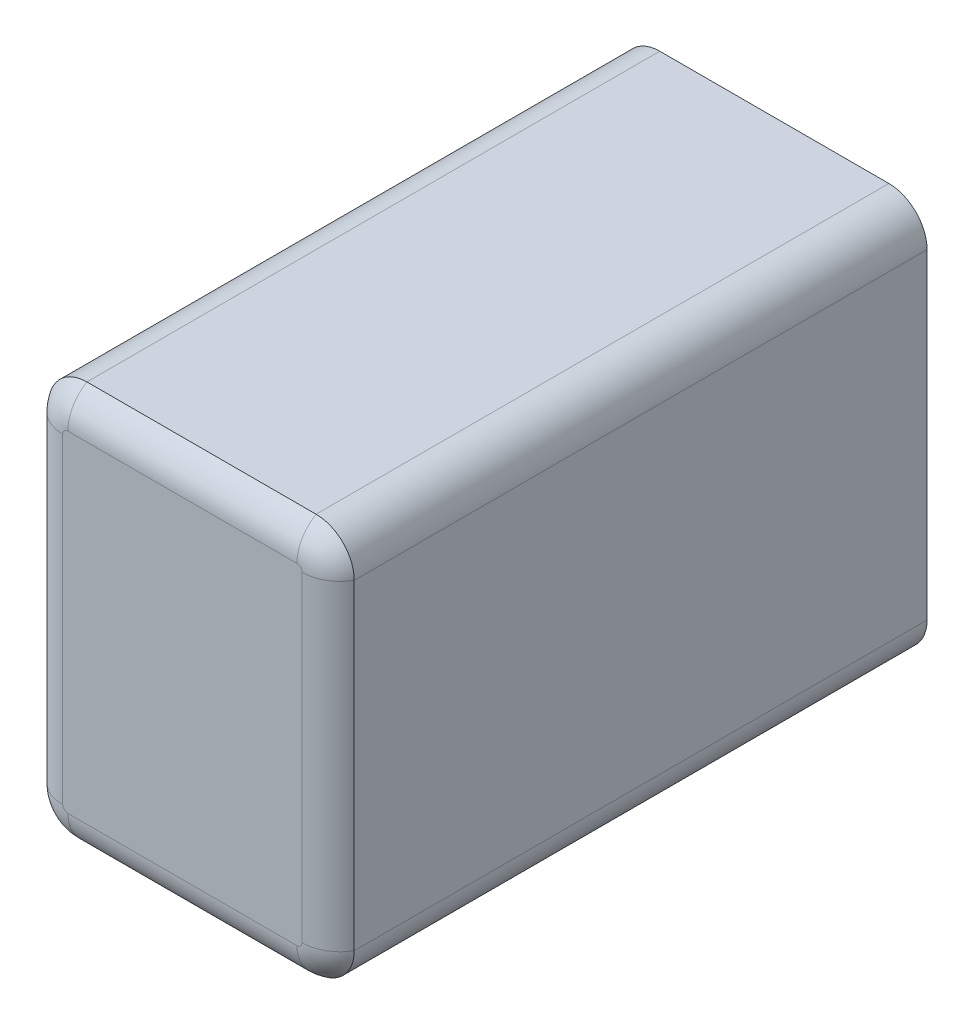
ISO-10303-21;
HEADER;
FILE_DESCRIPTION(('STEP AP214'),'2;1');
FILE_NAME('part.step','',(''),(''),'','','');
FILE_SCHEMA(('AUTOMOTIVE_DESIGN { 1 0 10303 214 1 1 1 1 }'));
ENDSEC;
DATA;
#1=APPLICATION_CONTEXT('core data for automotive mechanical design processes');
#2=APPLICATION_PROTOCOL_DEFINITION('international standard','automotive_design',2000,#1);
#3=PRODUCT_CONTEXT('',#1,'mechanical');
#4=PRODUCT('Part','Part','',(#3));
#5=PRODUCT_RELATED_PRODUCT_CATEGORY('part','',(#4));
#6=PRODUCT_DEFINITION_FORMATION('','',#4);
#7=PRODUCT_DEFINITION_CONTEXT('part definition',#1,'design');
#8=PRODUCT_DEFINITION('design','',#6,#7);
#9=PRODUCT_DEFINITION_SHAPE('','',#8);
#10=(LENGTH_UNIT() NAMED_UNIT(*) SI_UNIT(.MILLI.,.METRE.));
#11=(NAMED_UNIT(*) PLANE_ANGLE_UNIT() SI_UNIT($,.RADIAN.));
#12=(NAMED_UNIT(*) SI_UNIT($,.STERADIAN.) SOLID_ANGLE_UNIT());
#13=UNCERTAINTY_MEASURE_WITH_UNIT(LENGTH_MEASURE(1.E-05),#10,'distance_accuracy_value','');
#14=(GEOMETRIC_REPRESENTATION_CONTEXT(3) GLOBAL_UNCERTAINTY_ASSIGNED_CONTEXT((#13)) GLOBAL_UNIT_ASSIGNED_CONTEXT((#10,
#11,#12)) REPRESENTATION_CONTEXT('',''));
#15=CARTESIAN_POINT('',(0.,0.,0.));
#16=DIRECTION('',(0.,0.,1.));
#17=DIRECTION('',(1.,0.,0.));
#18=AXIS2_PLACEMENT_3D('',#15,#16,#17);
#19=CARTESIAN_POINT('',(-30.,42.,150.));
#20=DIRECTION('',(0.,0.,-1.));
#21=DIRECTION('',(-1.,0.,0.));
#22=AXIS2_PLACEMENT_3D('',#19,#20,#21);
#23=CYLINDRICAL_SURFACE('',#22,10.);
#24=CARTESIAN_POINT('',(-30.,42.,0.));
#25=DIRECTION('',(0.,0.,1.));
#26=DIRECTION('',(1.,0.,0.));
#27=AXIS2_PLACEMENT_3D('',#24,#25,#26);
#28=CIRCLE('',#27,10.);
#29=CARTESIAN_POINT('',(-30.,52.,0.));
#30=VERTEX_POINT('',#29);
#31=CARTESIAN_POINT('',(-40.,42.,0.));
#32=VERTEX_POINT('',#31);
#33=EDGE_CURVE('E366',#30,#32,#28,.T.);
#34=ORIENTED_EDGE('',*,*,#33,.T.);
#35=DIRECTION('',(0.,0.,-1.));
#36=VECTOR('',#35,1.);
#37=CARTESIAN_POINT('',(-40.,42.,150.));
#38=LINE('',#37,#36);
#39=CARTESIAN_POINT('',(-40.,42.,150.));
#40=VERTEX_POINT('',#39);
#41=EDGE_CURVE('E418',#40,#32,#38,.T.);
#42=ORIENTED_EDGE('',*,*,#41,.F.);
#43=CARTESIAN_POINT('',(-30.,42.,150.));
#44=DIRECTION('',(0.,0.,1.));
#45=DIRECTION('',(1.,0.,0.));
#46=AXIS2_PLACEMENT_3D('',#43,#44,#45);
#47=CIRCLE('',#46,10.);
#48=CARTESIAN_POINT('',(-30.,52.,150.));
#49=VERTEX_POINT('',#48);
#50=EDGE_CURVE('E332',#49,#40,#47,.T.);
#51=ORIENTED_EDGE('',*,*,#50,.F.);
#52=DIRECTION('',(0.,0.,-1.));
#53=VECTOR('',#52,1.);
#54=CARTESIAN_POINT('',(-30.,52.,150.));
#55=LINE('',#54,#53);
#56=EDGE_CURVE('E365',#49,#30,#55,.T.);
#57=ORIENTED_EDGE('',*,*,#56,.T.);
#58=EDGE_LOOP('',(#34,#42,#51,#57));
#59=FACE_BOUND('',#58,.T.);
#60=ADVANCED_FACE('F41',(#59),#23,.T.);
#61=CARTESIAN_POINT('',(-40.,42.,150.));
#62=DIRECTION('',(1.,0.,0.));
#63=DIRECTION('',(0.,0.,-1.));
#64=AXIS2_PLACEMENT_3D('',#61,#62,#63);
#65=PLANE('',#64);
#66=DIRECTION('',(0.,-1.,0.));
#67=VECTOR('',#66,1.);
#68=CARTESIAN_POINT('',(-40.,42.,0.));
#69=LINE('',#68,#67);
#70=CARTESIAN_POINT('',(-40.,-42.,0.));
#71=VERTEX_POINT('',#70);
#72=EDGE_CURVE('E370',#32,#71,#69,.T.);
#73=ORIENTED_EDGE('',*,*,#72,.T.);
#74=DIRECTION('',(0.,0.,-1.));
#75=VECTOR('',#74,1.);
#76=CARTESIAN_POINT('',(-40.,-42.,150.));
#77=LINE('',#76,#75);
#78=CARTESIAN_POINT('',(-40.,-42.,150.));
#79=VERTEX_POINT('',#78);
#80=EDGE_CURVE('E414',#79,#71,#77,.T.);
#81=ORIENTED_EDGE('',*,*,#80,.F.);
#82=DIRECTION('',(0.,-1.,0.));
#83=VECTOR('',#82,1.);
#84=CARTESIAN_POINT('',(-40.,42.,150.));
#85=LINE('',#84,#83);
#86=EDGE_CURVE('E336',#40,#79,#85,.T.);
#87=ORIENTED_EDGE('',*,*,#86,.F.);
#88=ORIENTED_EDGE('',*,*,#41,.T.);
#89=EDGE_LOOP('',(#73,#81,#87,#88));
#90=FACE_BOUND('',#89,.T.);
#91=ADVANCED_FACE('F495',(#90),#65,.F.);
#92=CARTESIAN_POINT('',(-30.,-42.,150.));
#93=DIRECTION('',(0.,0.,-1.));
#94=DIRECTION('',(-1.,0.,0.));
#95=AXIS2_PLACEMENT_3D('',#92,#93,#94);
#96=CYLINDRICAL_SURFACE('',#95,10.);
#97=CARTESIAN_POINT('',(-30.,-42.,0.));
#98=DIRECTION('',(0.,0.,1.));
#99=DIRECTION('',(-1.,0.,0.));
#100=AXIS2_PLACEMENT_3D('',#97,#98,#99);
#101=CIRCLE('',#100,10.);
#102=CARTESIAN_POINT('',(-30.,-52.,0.));
#103=VERTEX_POINT('',#102);
#104=EDGE_CURVE('E374',#71,#103,#101,.T.);
#105=ORIENTED_EDGE('',*,*,#104,.T.);
#106=DIRECTION('',(0.,0.,-1.));
#107=VECTOR('',#106,1.);
#108=CARTESIAN_POINT('',(-30.,-52.,150.));
#109=LINE('',#108,#107);
#110=CARTESIAN_POINT('',(-30.,-52.,150.));
#111=VERTEX_POINT('',#110);
#112=EDGE_CURVE('E410',#111,#103,#109,.T.);
#113=ORIENTED_EDGE('',*,*,#112,.F.);
#114=CARTESIAN_POINT('',(-30.,-42.,150.));
#115=DIRECTION('',(0.,0.,1.));
#116=DIRECTION('',(-1.,0.,0.));
#117=AXIS2_PLACEMENT_3D('',#114,#115,#116);
#118=CIRCLE('',#117,10.);
#119=EDGE_CURVE('E341',#79,#111,#118,.T.);
#120=ORIENTED_EDGE('',*,*,#119,.F.);
#121=ORIENTED_EDGE('',*,*,#80,.T.);
#122=EDGE_LOOP('',(#105,#113,#120,#121));
#123=FACE_BOUND('',#122,.T.);
#124=ADVANCED_FACE('F519',(#123),#96,.T.);
#125=CARTESIAN_POINT('',(-30.,-52.,150.));
#126=DIRECTION('',(0.,1.,0.));
#127=DIRECTION('',(0.,0.,1.));
#128=AXIS2_PLACEMENT_3D('',#125,#126,#127);
#129=PLANE('',#128);
#130=DIRECTION('',(1.,0.,0.));
#131=VECTOR('',#130,1.);
#132=CARTESIAN_POINT('',(-30.,-52.,0.));
#133=LINE('',#132,#131);
#134=CARTESIAN_POINT('',(30.,-52.,0.));
#135=VERTEX_POINT('',#134);
#136=EDGE_CURVE('E377',#103,#135,#133,.T.);
#137=ORIENTED_EDGE('',*,*,#136,.T.);
#138=DIRECTION('',(0.,0.,-1.));
#139=VECTOR('',#138,1.);
#140=CARTESIAN_POINT('',(30.,-52.,150.));
#141=LINE('',#140,#139);
#142=CARTESIAN_POINT('',(30.,-52.,150.));
#143=VERTEX_POINT('',#142);
#144=EDGE_CURVE('E406',#143,#135,#141,.T.);
#145=ORIENTED_EDGE('',*,*,#144,.F.);
#146=DIRECTION('',(1.,0.,0.));
#147=VECTOR('',#146,1.);
#148=CARTESIAN_POINT('',(-30.,-52.,150.));
#149=LINE('',#148,#147);
#150=EDGE_CURVE('E345',#111,#143,#149,.T.);
#151=ORIENTED_EDGE('',*,*,#150,.F.);
#152=ORIENTED_EDGE('',*,*,#112,.T.);
#153=EDGE_LOOP('',(#137,#145,#151,#152));
#154=FACE_BOUND('',#153,.T.);
#155=ADVANCED_FACE('F515',(#154),#129,.F.);
#156=CARTESIAN_POINT('',(30.,-42.,150.));
#157=DIRECTION('',(0.,0.,-1.));
#158=DIRECTION('',(-1.,0.,0.));
#159=AXIS2_PLACEMENT_3D('',#156,#157,#158);
#160=CYLINDRICAL_SURFACE('',#159,10.);
#161=CARTESIAN_POINT('',(30.,-42.,0.));
#162=DIRECTION('',(0.,0.,1.));
#163=DIRECTION('',(1.,0.,0.));
#164=AXIS2_PLACEMENT_3D('',#161,#162,#163);
#165=CIRCLE('',#164,10.);
#166=CARTESIAN_POINT('',(40.,-42.,0.));
#167=VERTEX_POINT('',#166);
#168=EDGE_CURVE('E380',#135,#167,#165,.T.);
#169=ORIENTED_EDGE('',*,*,#168,.T.);
#170=DIRECTION('',(0.,0.,-1.));
#171=VECTOR('',#170,1.);
#172=CARTESIAN_POINT('',(40.,-42.,150.));
#173=LINE('',#172,#171);
#174=CARTESIAN_POINT('',(40.,-42.,150.));
#175=VERTEX_POINT('',#174);
#176=EDGE_CURVE('E402',#175,#167,#173,.T.);
#177=ORIENTED_EDGE('',*,*,#176,.F.);
#178=CARTESIAN_POINT('',(30.,-42.,150.));
#179=DIRECTION('',(0.,0.,1.));
#180=DIRECTION('',(1.,0.,0.));
#181=AXIS2_PLACEMENT_3D('',#178,#179,#180);
#182=CIRCLE('',#181,10.);
#183=EDGE_CURVE('E349',#143,#175,#182,.T.);
#184=ORIENTED_EDGE('',*,*,#183,.F.);
#185=ORIENTED_EDGE('',*,*,#144,.T.);
#186=EDGE_LOOP('',(#169,#177,#184,#185));
#187=FACE_BOUND('',#186,.T.);
#188=ADVANCED_FACE('F526',(#187),#160,.T.);
#189=CARTESIAN_POINT('',(40.,42.,150.));
#190=DIRECTION('',(-1.,0.,0.));
#191=DIRECTION('',(0.,0.,1.));
#192=AXIS2_PLACEMENT_3D('',#189,#190,#191);
#193=PLANE('',#192);
#194=DIRECTION('',(0.,1.,0.));
#195=VECTOR('',#194,1.);
#196=CARTESIAN_POINT('',(40.,42.,0.));
#197=LINE('',#196,#195);
#198=CARTESIAN_POINT('',(40.,42.,0.));
#199=VERTEX_POINT('',#198);
#200=EDGE_CURVE('E383',#167,#199,#197,.T.);
#201=ORIENTED_EDGE('',*,*,#200,.T.);
#202=DIRECTION('',(0.,0.,-1.));
#203=VECTOR('',#202,1.);
#204=CARTESIAN_POINT('',(40.,42.,150.));
#205=LINE('',#204,#203);
#206=CARTESIAN_POINT('',(40.,42.,150.));
#207=VERTEX_POINT('',#206);
#208=EDGE_CURVE('E398',#207,#199,#205,.T.);
#209=ORIENTED_EDGE('',*,*,#208,.F.);
#210=DIRECTION('',(0.,1.,0.));
#211=VECTOR('',#210,1.);
#212=CARTESIAN_POINT('',(40.,42.,150.));
#213=LINE('',#212,#211);
#214=EDGE_CURVE('E353',#175,#207,#213,.T.);
#215=ORIENTED_EDGE('',*,*,#214,.F.);
#216=ORIENTED_EDGE('',*,*,#176,.T.);
#217=EDGE_LOOP('',(#201,#209,#215,#216));
#218=FACE_BOUND('',#217,.T.);
#219=ADVANCED_FACE('F575',(#218),#193,.F.);
#220=CARTESIAN_POINT('',(30.,42.,150.));
#221=DIRECTION('',(0.,0.,-1.));
#222=DIRECTION('',(-1.,0.,0.));
#223=AXIS2_PLACEMENT_3D('',#220,#221,#222);
#224=CYLINDRICAL_SURFACE('',#223,10.);
#225=CARTESIAN_POINT('',(30.,42.,0.));
#226=DIRECTION('',(0.,0.,1.));
#227=DIRECTION('',(-1.,0.,0.));
#228=AXIS2_PLACEMENT_3D('',#225,#226,#227);
#229=CIRCLE('',#228,10.);
#230=CARTESIAN_POINT('',(30.,52.,0.));
#231=VERTEX_POINT('',#230);
#232=EDGE_CURVE('E386',#199,#231,#229,.T.);
#233=ORIENTED_EDGE('',*,*,#232,.T.);
#234=DIRECTION('',(0.,0.,-1.));
#235=VECTOR('',#234,1.);
#236=CARTESIAN_POINT('',(30.,52.,150.));
#237=LINE('',#236,#235);
#238=CARTESIAN_POINT('',(30.,52.,150.));
#239=VERTEX_POINT('',#238);
#240=EDGE_CURVE('E394',#239,#231,#237,.T.);
#241=ORIENTED_EDGE('',*,*,#240,.F.);
#242=CARTESIAN_POINT('',(30.,42.,150.));
#243=DIRECTION('',(0.,0.,1.));
#244=DIRECTION('',(-1.,0.,0.));
#245=AXIS2_PLACEMENT_3D('',#242,#243,#244);
#246=CIRCLE('',#245,10.);
#247=EDGE_CURVE('E357',#207,#239,#246,.T.);
#248=ORIENTED_EDGE('',*,*,#247,.F.);
#249=ORIENTED_EDGE('',*,*,#208,.T.);
#250=EDGE_LOOP('',(#233,#241,#248,#249));
#251=FACE_BOUND('',#250,.T.);
#252=ADVANCED_FACE('F480',(#251),#224,.T.);
#253=CARTESIAN_POINT('',(-30.,52.,150.));
#254=DIRECTION('',(0.,-1.,0.));
#255=DIRECTION('',(0.,0.,-1.));
#256=AXIS2_PLACEMENT_3D('',#253,#254,#255);
#257=PLANE('',#256);
#258=DIRECTION('',(-1.,0.,0.));
#259=VECTOR('',#258,1.);
#260=CARTESIAN_POINT('',(-30.,52.,0.));
#261=LINE('',#260,#259);
#262=EDGE_CURVE('E337',#231,#30,#261,.T.);
#263=ORIENTED_EDGE('',*,*,#262,.T.);
#264=ORIENTED_EDGE('',*,*,#56,.F.);
#265=DIRECTION('',(-1.,0.,0.));
#266=VECTOR('',#265,1.);
#267=CARTESIAN_POINT('',(-30.,52.,150.));
#268=LINE('',#267,#266);
#269=EDGE_CURVE('E361',#239,#49,#268,.T.);
#270=ORIENTED_EDGE('',*,*,#269,.F.);
#271=ORIENTED_EDGE('',*,*,#240,.T.);
#272=EDGE_LOOP('',(#263,#264,#270,#271));
#273=FACE_BOUND('',#272,.T.);
#274=ADVANCED_FACE('F485',(#273),#257,.F.);
#275=CARTESIAN_POINT('',(-30.,42.,0.));
#276=DIRECTION('',(0.,0.,1.));
#277=DIRECTION('',(1.,0.,0.));
#278=AXIS2_PLACEMENT_3D('',#275,#276,#277);
#279=PLANE('',#278);
#280=DIRECTION('',(-1.,0.,0.));
#281=VECTOR('',#280,1.);
#282=CARTESIAN_POINT('',(-30.,50.,0.));
#283=LINE('',#282,#281);
#284=CARTESIAN_POINT('',(30.,50.,0.));
#285=VERTEX_POINT('',#284);
#286=CARTESIAN_POINT('',(-30.,50.,0.));
#287=VERTEX_POINT('',#286);
#288=EDGE_CURVE('E217',#285,#287,#283,.T.);
#289=ORIENTED_EDGE('',*,*,#288,.T.);
#290=CARTESIAN_POINT('',(-30.,42.,0.));
#291=DIRECTION('',(0.,0.,1.));
#292=DIRECTION('',(1.,0.,0.));
#293=AXIS2_PLACEMENT_3D('',#290,#291,#292);
#294=CIRCLE('',#293,8.00000000000001);
#295=CARTESIAN_POINT('',(-38.,42.,0.));
#296=VERTEX_POINT('',#295);
#297=EDGE_CURVE('E223',#287,#296,#294,.T.);
#298=ORIENTED_EDGE('',*,*,#297,.T.);
#299=DIRECTION('',(0.,-1.,0.));
#300=VECTOR('',#299,1.);
#301=CARTESIAN_POINT('',(-38.,42.,0.));
#302=LINE('',#301,#300);
#303=CARTESIAN_POINT('',(-38.,-42.,0.));
#304=VERTEX_POINT('',#303);
#305=EDGE_CURVE('E306',#296,#304,#302,.T.);
#306=ORIENTED_EDGE('',*,*,#305,.T.);
#307=CARTESIAN_POINT('',(-30.,-42.,0.));
#308=DIRECTION('',(0.,0.,1.));
#309=DIRECTION('',(1.,0.,0.));
#310=AXIS2_PLACEMENT_3D('',#307,#308,#309);
#311=CIRCLE('',#310,8.00000000000001);
#312=CARTESIAN_POINT('',(-30.,-50.,0.));
#313=VERTEX_POINT('',#312);
#314=EDGE_CURVE('E325',#304,#313,#311,.T.);
#315=ORIENTED_EDGE('',*,*,#314,.T.);
#316=DIRECTION('',(1.,0.,0.));
#317=VECTOR('',#316,1.);
#318=CARTESIAN_POINT('',(-30.,-50.,0.));
#319=LINE('',#318,#317);
#320=CARTESIAN_POINT('',(30.,-50.,0.));
#321=VERTEX_POINT('',#320);
#322=EDGE_CURVE('E321',#313,#321,#319,.T.);
#323=ORIENTED_EDGE('',*,*,#322,.T.);
#324=CARTESIAN_POINT('',(30.,-42.,0.));
#325=DIRECTION('',(0.,0.,1.));
#326=DIRECTION('',(1.,0.,0.));
#327=AXIS2_PLACEMENT_3D('',#324,#325,#326);
#328=CIRCLE('',#327,8.00000000000001);
#329=CARTESIAN_POINT('',(38.,-42.,0.));
#330=VERTEX_POINT('',#329);
#331=EDGE_CURVE('E317',#321,#330,#328,.T.);
#332=ORIENTED_EDGE('',*,*,#331,.T.);
#333=DIRECTION('',(0.,1.,0.));
#334=VECTOR('',#333,1.);
#335=CARTESIAN_POINT('',(38.,42.,0.));
#336=LINE('',#335,#334);
#337=CARTESIAN_POINT('',(38.,42.,0.));
#338=VERTEX_POINT('',#337);
#339=EDGE_CURVE('E313',#330,#338,#336,.T.);
#340=ORIENTED_EDGE('',*,*,#339,.T.);
#341=CARTESIAN_POINT('',(30.,42.,0.));
#342=DIRECTION('',(0.,0.,1.));
#343=DIRECTION('',(1.,0.,0.));
#344=AXIS2_PLACEMENT_3D('',#341,#342,#343);
#345=CIRCLE('',#344,8.00000000000001);
#346=EDGE_CURVE('E309',#338,#285,#345,.T.);
#347=ORIENTED_EDGE('',*,*,#346,.T.);
#348=EDGE_LOOP('',(#289,#298,#306,#315,#323,#332,#340,#347));
#349=FACE_BOUND('',#348,.T.);
#350=ORIENTED_EDGE('',*,*,#33,.F.);
#351=ORIENTED_EDGE('',*,*,#262,.F.);
#352=ORIENTED_EDGE('',*,*,#232,.F.);
#353=ORIENTED_EDGE('',*,*,#200,.F.);
#354=ORIENTED_EDGE('',*,*,#168,.F.);
#355=ORIENTED_EDGE('',*,*,#136,.F.);
#356=ORIENTED_EDGE('',*,*,#104,.F.);
#357=ORIENTED_EDGE('',*,*,#72,.F.);
#358=EDGE_LOOP('',(#350,#351,#352,#353,#354,#355,#356,#357));
#359=FACE_BOUND('',#358,.T.);
#360=ADVANCED_FACE('F490',(#349,#359),#279,.F.);
#361=CARTESIAN_POINT('',(0.,0.,155.));
#362=DIRECTION('',(0.,0.,1.));
#363=DIRECTION('',(1.,0.,0.));
#364=AXIS2_PLACEMENT_3D('',#361,#362,#363);
#365=PLANE('',#364);
#366=DIRECTION('',(0.,-1.,0.));
#367=VECTOR('',#366,1.);
#368=CARTESIAN_POINT('',(-31.3397459621556,-42.,155.));
#369=LINE('',#368,#367);
#370=CARTESIAN_POINT('',(-31.3397459621556,42.,155.));
#371=VERTEX_POINT('',#370);
#372=CARTESIAN_POINT('',(-31.3397459621556,-42.,155.));
#373=VERTEX_POINT('',#372);
#374=EDGE_CURVE('E51',#371,#373,#369,.T.);
#375=ORIENTED_EDGE('',*,*,#374,.T.);
#376=CARTESIAN_POINT('',(-30.,-42.,155.));
#377=DIRECTION('',(0.,0.,1.));
#378=DIRECTION('',(1.,0.,0.));
#379=AXIS2_PLACEMENT_3D('',#376,#377,#378);
#380=CIRCLE('',#379,1.33974596215563);
#381=CARTESIAN_POINT('',(-30.,-43.3397459621556,155.));
#382=VERTEX_POINT('',#381);
#383=EDGE_CURVE('E11',#373,#382,#380,.T.);
#384=ORIENTED_EDGE('',*,*,#383,.T.);
#385=DIRECTION('',(1.,0.,0.));
#386=VECTOR('',#385,1.);
#387=CARTESIAN_POINT('',(30.,-43.3397459621556,155.));
#388=LINE('',#387,#386);
#389=CARTESIAN_POINT('',(30.,-43.3397459621556,155.));
#390=VERTEX_POINT('',#389);
#391=EDGE_CURVE('E422',#382,#390,#388,.T.);
#392=ORIENTED_EDGE('',*,*,#391,.T.);
#393=CARTESIAN_POINT('',(30.,-42.,155.));
#394=DIRECTION('',(0.,0.,1.));
#395=DIRECTION('',(1.,0.,0.));
#396=AXIS2_PLACEMENT_3D('',#393,#394,#395);
#397=CIRCLE('',#396,1.33974596215562);
#398=CARTESIAN_POINT('',(31.3397459621556,-42.,155.));
#399=VERTEX_POINT('',#398);
#400=EDGE_CURVE('E425',#390,#399,#397,.T.);
#401=ORIENTED_EDGE('',*,*,#400,.T.);
#402=DIRECTION('',(0.,1.,0.));
#403=VECTOR('',#402,1.);
#404=CARTESIAN_POINT('',(31.3397459621556,42.,155.));
#405=LINE('',#404,#403);
#406=CARTESIAN_POINT('',(31.3397459621556,42.,155.));
#407=VERTEX_POINT('',#406);
#408=EDGE_CURVE('E428',#399,#407,#405,.T.);
#409=ORIENTED_EDGE('',*,*,#408,.T.);
#410=CARTESIAN_POINT('',(30.,42.,155.));
#411=DIRECTION('',(0.,0.,1.));
#412=DIRECTION('',(1.,0.,0.));
#413=AXIS2_PLACEMENT_3D('',#410,#411,#412);
#414=CIRCLE('',#413,1.33974596215564);
#415=CARTESIAN_POINT('',(30.,43.3397459621556,155.));
#416=VERTEX_POINT('',#415);
#417=EDGE_CURVE('E431',#407,#416,#414,.T.);
#418=ORIENTED_EDGE('',*,*,#417,.T.);
#419=DIRECTION('',(-1.,0.,0.));
#420=VECTOR('',#419,1.);
#421=CARTESIAN_POINT('',(-30.,43.3397459621556,155.));
#422=LINE('',#421,#420);
#423=CARTESIAN_POINT('',(-30.,43.3397459621556,155.));
#424=VERTEX_POINT('',#423);
#425=EDGE_CURVE('E434',#416,#424,#422,.T.);
#426=ORIENTED_EDGE('',*,*,#425,.T.);
#427=CARTESIAN_POINT('',(-30.,42.,155.));
#428=DIRECTION('',(0.,0.,1.));
#429=DIRECTION('',(1.,0.,0.));
#430=AXIS2_PLACEMENT_3D('',#427,#428,#429);
#431=CIRCLE('',#430,1.33974596215564);
#432=EDGE_CURVE('E62',#424,#371,#431,.T.);
#433=ORIENTED_EDGE('',*,*,#432,.T.);
#434=EDGE_LOOP('',(#375,#384,#392,#401,#409,#418,#426,#433));
#435=FACE_BOUND('',#434,.T.);
#436=ADVANCED_FACE('F505',(#435),#365,.T.);
#437=CARTESIAN_POINT('',(-30.,42.,150.));
#438=DIRECTION('',(0.,0.,-1.));
#439=DIRECTION('',(-1.,0.,0.));
#440=AXIS2_PLACEMENT_3D('',#437,#438,#439);
#441=CYLINDRICAL_SURFACE('',#440,8.00000000000001);
#442=ORIENTED_EDGE('',*,*,#297,.F.);
#443=DIRECTION('',(0.,0.,-1.));
#444=VECTOR('',#443,1.);
#445=CARTESIAN_POINT('',(-30.,50.,150.));
#446=LINE('',#445,#444);
#447=CARTESIAN_POINT('',(-30.,50.,149.501343994314));
#448=VERTEX_POINT('',#447);
#449=EDGE_CURVE('E220',#448,#287,#446,.T.);
#450=ORIENTED_EDGE('',*,*,#449,.F.);
#451=CARTESIAN_POINT('',(-30.,42.,149.501343994314));
#452=DIRECTION('',(0.,0.,-1.));
#453=DIRECTION('',(-1.,0.,0.));
#454=AXIS2_PLACEMENT_3D('',#451,#452,#453);
#455=CIRCLE('',#454,8.00000000000001);
#456=CARTESIAN_POINT('',(-38.,42.,149.501343994314));
#457=VERTEX_POINT('',#456);
#458=EDGE_CURVE('E204',#448,#457,#455,.F.);
#459=ORIENTED_EDGE('',*,*,#458,.T.);
#460=DIRECTION('',(0.,0.,-1.));
#461=VECTOR('',#460,1.);
#462=CARTESIAN_POINT('',(-38.,42.,150.));
#463=LINE('',#462,#461);
#464=EDGE_CURVE('E371',#457,#296,#463,.T.);
#465=ORIENTED_EDGE('',*,*,#464,.T.);
#466=EDGE_LOOP('',(#442,#450,#459,#465));
#467=FACE_BOUND('',#466,.T.);
#468=ADVANCED_FACE('F221',(#467),#441,.F.);
#469=CARTESIAN_POINT('',(-38.,42.,150.));
#470=DIRECTION('',(1.,0.,0.));
#471=DIRECTION('',(0.,0.,-1.));
#472=AXIS2_PLACEMENT_3D('',#469,#470,#471);
#473=PLANE('',#472);
#474=ORIENTED_EDGE('',*,*,#305,.F.);
#475=ORIENTED_EDGE('',*,*,#464,.F.);
#476=DIRECTION('',(0.,1.,0.));
#477=VECTOR('',#476,1.);
#478=CARTESIAN_POINT('',(-38.,42.,149.501343994314));
#479=LINE('',#478,#477);
#480=CARTESIAN_POINT('',(-38.,-42.,149.501343994314));
#481=VERTEX_POINT('',#480);
#482=EDGE_CURVE('E216',#457,#481,#479,.F.);
#483=ORIENTED_EDGE('',*,*,#482,.T.);
#484=DIRECTION('',(0.,0.,-1.));
#485=VECTOR('',#484,1.);
#486=CARTESIAN_POINT('',(-38.,-42.,150.));
#487=LINE('',#486,#485);
#488=EDGE_CURVE('E871',#481,#304,#487,.T.);
#489=ORIENTED_EDGE('',*,*,#488,.T.);
#490=EDGE_LOOP('',(#474,#475,#483,#489));
#491=FACE_BOUND('',#490,.T.);
#492=ADVANCED_FACE('F614',(#491),#473,.T.);
#493=CARTESIAN_POINT('',(-30.,-42.,150.));
#494=DIRECTION('',(0.,0.,-1.));
#495=DIRECTION('',(-1.,0.,0.));
#496=AXIS2_PLACEMENT_3D('',#493,#494,#495);
#497=CYLINDRICAL_SURFACE('',#496,8.00000000000001);
#498=ORIENTED_EDGE('',*,*,#314,.F.);
#499=ORIENTED_EDGE('',*,*,#488,.F.);
#500=CARTESIAN_POINT('',(-30.,-42.,149.501343994314));
#501=DIRECTION('',(0.,0.,-1.));
#502=DIRECTION('',(-1.,0.,0.));
#503=AXIS2_PLACEMENT_3D('',#500,#501,#502);
#504=CIRCLE('',#503,8.00000000000001);
#505=CARTESIAN_POINT('',(-30.,-50.,149.501343994314));
#506=VERTEX_POINT('',#505);
#507=EDGE_CURVE('E864',#481,#506,#504,.F.);
#508=ORIENTED_EDGE('',*,*,#507,.T.);
#509=DIRECTION('',(0.,0.,1.));
#510=VECTOR('',#509,1.);
#511=CARTESIAN_POINT('',(-30.,-50.,150.));
#512=LINE('',#511,#510);
#513=EDGE_CURVE('E859',#506,#313,#512,.F.);
#514=ORIENTED_EDGE('',*,*,#513,.T.);
#515=EDGE_LOOP('',(#498,#499,#508,#514));
#516=FACE_BOUND('',#515,.T.);
#517=ADVANCED_FACE('F621',(#516),#497,.F.);
#518=CARTESIAN_POINT('',(-30.,-50.,150.));
#519=DIRECTION('',(0.,1.,0.));
#520=DIRECTION('',(0.,0.,1.));
#521=AXIS2_PLACEMENT_3D('',#518,#519,#520);
#522=PLANE('',#521);
#523=ORIENTED_EDGE('',*,*,#322,.F.);
#524=ORIENTED_EDGE('',*,*,#513,.F.);
#525=DIRECTION('',(-1.,0.,0.));
#526=VECTOR('',#525,1.);
#527=CARTESIAN_POINT('',(-30.,-50.,149.501343994314));
#528=LINE('',#527,#526);
#529=CARTESIAN_POINT('',(30.,-50.,149.501343994314));
#530=VERTEX_POINT('',#529);
#531=EDGE_CURVE('E845',#506,#530,#528,.F.);
#532=ORIENTED_EDGE('',*,*,#531,.T.);
#533=DIRECTION('',(0.,0.,-1.));
#534=VECTOR('',#533,1.);
#535=CARTESIAN_POINT('',(30.,-50.,150.));
#536=LINE('',#535,#534);
#537=EDGE_CURVE('E855',#530,#321,#536,.T.);
#538=ORIENTED_EDGE('',*,*,#537,.T.);
#539=EDGE_LOOP('',(#523,#524,#532,#538));
#540=FACE_BOUND('',#539,.T.);
#541=ADVANCED_FACE('F629',(#540),#522,.T.);
#542=CARTESIAN_POINT('',(30.,-42.,150.));
#543=DIRECTION('',(0.,0.,-1.));
#544=DIRECTION('',(-1.,0.,0.));
#545=AXIS2_PLACEMENT_3D('',#542,#543,#544);
#546=CYLINDRICAL_SURFACE('',#545,8.00000000000001);
#547=ORIENTED_EDGE('',*,*,#331,.F.);
#548=ORIENTED_EDGE('',*,*,#537,.F.);
#549=CARTESIAN_POINT('',(30.,-42.,149.501343994314));
#550=DIRECTION('',(0.,0.,-1.));
#551=DIRECTION('',(-1.,0.,0.));
#552=AXIS2_PLACEMENT_3D('',#549,#550,#551);
#553=CIRCLE('',#552,8.00000000000001);
#554=CARTESIAN_POINT('',(38.,-42.,149.501343994314));
#555=VERTEX_POINT('',#554);
#556=EDGE_CURVE('E842',#530,#555,#553,.F.);
#557=ORIENTED_EDGE('',*,*,#556,.T.);
#558=DIRECTION('',(0.,0.,1.));
#559=VECTOR('',#558,1.);
#560=CARTESIAN_POINT('',(38.,-42.,150.));
#561=LINE('',#560,#559);
#562=EDGE_CURVE('E852',#555,#330,#561,.F.);
#563=ORIENTED_EDGE('',*,*,#562,.T.);
#564=EDGE_LOOP('',(#547,#548,#557,#563));
#565=FACE_BOUND('',#564,.T.);
#566=ADVANCED_FACE('F637',(#565),#546,.F.);
#567=CARTESIAN_POINT('',(38.,42.,150.));
#568=DIRECTION('',(-1.,0.,0.));
#569=DIRECTION('',(0.,0.,1.));
#570=AXIS2_PLACEMENT_3D('',#567,#568,#569);
#571=PLANE('',#570);
#572=ORIENTED_EDGE('',*,*,#339,.F.);
#573=ORIENTED_EDGE('',*,*,#562,.F.);
#574=DIRECTION('',(0.,-1.,0.));
#575=VECTOR('',#574,1.);
#576=CARTESIAN_POINT('',(38.,42.,149.501343994314));
#577=LINE('',#576,#575);
#578=CARTESIAN_POINT('',(38.,42.,149.501343994314));
#579=VERTEX_POINT('',#578);
#580=EDGE_CURVE('E247',#555,#579,#577,.F.);
#581=ORIENTED_EDGE('',*,*,#580,.T.);
#582=DIRECTION('',(0.,0.,-1.));
#583=VECTOR('',#582,1.);
#584=CARTESIAN_POINT('',(38.,42.,150.));
#585=LINE('',#584,#583);
#586=EDGE_CURVE('E848',#579,#338,#585,.T.);
#587=ORIENTED_EDGE('',*,*,#586,.T.);
#588=EDGE_LOOP('',(#572,#573,#581,#587));
#589=FACE_BOUND('',#588,.T.);
#590=ADVANCED_FACE('F645',(#589),#571,.T.);
#591=CARTESIAN_POINT('',(30.,42.,150.));
#592=DIRECTION('',(0.,0.,-1.));
#593=DIRECTION('',(-1.,0.,0.));
#594=AXIS2_PLACEMENT_3D('',#591,#592,#593);
#595=CYLINDRICAL_SURFACE('',#594,8.00000000000001);
#596=ORIENTED_EDGE('',*,*,#346,.F.);
#597=ORIENTED_EDGE('',*,*,#586,.F.);
#598=CARTESIAN_POINT('',(30.,42.,149.501343994314));
#599=DIRECTION('',(0.,0.,-1.));
#600=DIRECTION('',(-1.,0.,0.));
#601=AXIS2_PLACEMENT_3D('',#598,#599,#600);
#602=CIRCLE('',#601,8.00000000000001);
#603=CARTESIAN_POINT('',(30.,50.,149.501343994314));
#604=VERTEX_POINT('',#603);
#605=EDGE_CURVE('E243',#579,#604,#602,.F.);
#606=ORIENTED_EDGE('',*,*,#605,.T.);
#607=DIRECTION('',(0.,0.,-1.));
#608=VECTOR('',#607,1.);
#609=CARTESIAN_POINT('',(30.,50.,150.));
#610=LINE('',#609,#608);
#611=EDGE_CURVE('E229',#604,#285,#610,.T.);
#612=ORIENTED_EDGE('',*,*,#611,.T.);
#613=EDGE_LOOP('',(#596,#597,#606,#612));
#614=FACE_BOUND('',#613,.T.);
#615=ADVANCED_FACE('F653',(#614),#595,.F.);
#616=CARTESIAN_POINT('',(-30.,50.,150.));
#617=DIRECTION('',(0.,-1.,0.));
#618=DIRECTION('',(0.,0.,-1.));
#619=AXIS2_PLACEMENT_3D('',#616,#617,#618);
#620=PLANE('',#619);
#621=ORIENTED_EDGE('',*,*,#288,.F.);
#622=ORIENTED_EDGE('',*,*,#611,.F.);
#623=DIRECTION('',(1.,0.,0.));
#624=VECTOR('',#623,1.);
#625=CARTESIAN_POINT('',(-30.,50.,149.501343994314));
#626=LINE('',#625,#624);
#627=EDGE_CURVE('E230',#604,#448,#626,.F.);
#628=ORIENTED_EDGE('',*,*,#627,.T.);
#629=ORIENTED_EDGE('',*,*,#449,.T.);
#630=EDGE_LOOP('',(#621,#622,#628,#629));
#631=FACE_BOUND('',#630,.T.);
#632=ADVANCED_FACE('F241',(#631),#620,.T.);
#633=CARTESIAN_POINT('',(30.,42.,149.061056874428));
#634=DIRECTION('',(0.,0.,-1.));
#635=DIRECTION('',(-1.,0.,0.));
#636=AXIS2_PLACEMENT_3D('',#633,#634,#635);
#637=CONICAL_SURFACE('',#636,8.23410481428218,0.488692190558413);
#638=CARTESIAN_POINT('',(30.,42.,153.));
#639=DIRECTION('',(0.,0.,1.));
#640=DIRECTION('',(1.,0.,0.));
#641=AXIS2_PLACEMENT_3D('',#638,#639,#640);
#642=CIRCLE('',#641,6.13973160363752);
#643=CARTESIAN_POINT('',(36.1397316036375,42.,153.));
#644=VERTEX_POINT('',#643);
#645=CARTESIAN_POINT('',(30.,48.1397316036375,153.));
#646=VERTEX_POINT('',#645);
#647=EDGE_CURVE('E251',#644,#646,#642,.T.);
#648=ORIENTED_EDGE('',*,*,#647,.T.);
#649=DIRECTION('',(0.,-0.469471562785891,0.882947592858927));
#650=VECTOR('',#649,1.);
#651=CARTESIAN_POINT('',(30.,50.2341048142821,149.061056874428));
#652=LINE('',#651,#650);
#653=EDGE_CURVE('E239',#646,#604,#652,.F.);
#654=ORIENTED_EDGE('',*,*,#653,.T.);
#655=ORIENTED_EDGE('',*,*,#605,.F.);
#656=DIRECTION('',(0.469471562785891,0.,-0.882947592858927));
#657=VECTOR('',#656,1.);
#658=CARTESIAN_POINT('',(38.2341048142822,42.,149.061056874428));
#659=LINE('',#658,#657);
#660=EDGE_CURVE('E256',#644,#579,#659,.T.);
#661=ORIENTED_EDGE('',*,*,#660,.F.);
#662=EDGE_LOOP('',(#648,#654,#655,#661));
#663=FACE_BOUND('',#662,.T.);
#664=ADVANCED_FACE('F668',(#663),#637,.F.);
#665=CARTESIAN_POINT('',(-30.,50.2341048142821,149.061056874428));
#666=DIRECTION('',(0.,0.882947592858927,0.469471562785891));
#667=DIRECTION('',(0.,-0.469471562785891,0.882947592858927));
#668=AXIS2_PLACEMENT_3D('',#665,#666,#667);
#669=PLANE('',#668);
#670=DIRECTION('',(1.,0.,0.));
#671=VECTOR('',#670,1.);
#672=CARTESIAN_POINT('',(-30.,48.1397316036375,153.));
#673=LINE('',#672,#671);
#674=CARTESIAN_POINT('',(-30.,48.1397316036375,153.));
#675=VERTEX_POINT('',#674);
#676=EDGE_CURVE('E237',#646,#675,#673,.F.);
#677=ORIENTED_EDGE('',*,*,#676,.T.);
#678=DIRECTION('',(0.,0.469471562785891,-0.882947592858927));
#679=VECTOR('',#678,1.);
#680=CARTESIAN_POINT('',(-30.,50.2341048142821,149.061056874428));
#681=LINE('',#680,#679);
#682=EDGE_CURVE('E209',#675,#448,#681,.T.);
#683=ORIENTED_EDGE('',*,*,#682,.T.);
#684=ORIENTED_EDGE('',*,*,#627,.F.);
#685=ORIENTED_EDGE('',*,*,#653,.F.);
#686=EDGE_LOOP('',(#677,#683,#684,#685));
#687=FACE_BOUND('',#686,.T.);
#688=ADVANCED_FACE('F234',(#687),#669,.F.);
#689=CARTESIAN_POINT('',(-30.,42.,149.061056874428));
#690=DIRECTION('',(0.,0.,-1.));
#691=DIRECTION('',(-1.,0.,0.));
#692=AXIS2_PLACEMENT_3D('',#689,#690,#691);
#693=CONICAL_SURFACE('',#692,8.23410481428217,0.488692190558413);
#694=CARTESIAN_POINT('',(-30.,42.,153.));
#695=DIRECTION('',(0.,0.,1.));
#696=DIRECTION('',(1.,0.,0.));
#697=AXIS2_PLACEMENT_3D('',#694,#695,#696);
#698=CIRCLE('',#697,6.13973160363751);
#699=CARTESIAN_POINT('',(-36.1397316036375,42.,153.));
#700=VERTEX_POINT('',#699);
#701=EDGE_CURVE('E263',#675,#700,#698,.T.);
#702=ORIENTED_EDGE('',*,*,#701,.T.);
#703=DIRECTION('',(0.469471562785891,0.,0.882947592858927));
#704=VECTOR('',#703,1.);
#705=CARTESIAN_POINT('',(-38.2341048142822,42.,149.061056874428));
#706=LINE('',#705,#704);
#707=EDGE_CURVE('E212',#700,#457,#706,.F.);
#708=ORIENTED_EDGE('',*,*,#707,.T.);
#709=ORIENTED_EDGE('',*,*,#458,.F.);
#710=ORIENTED_EDGE('',*,*,#682,.F.);
#711=EDGE_LOOP('',(#702,#708,#709,#710));
#712=FACE_BOUND('',#711,.T.);
#713=ADVANCED_FACE('F207',(#712),#693,.F.);
#714=CARTESIAN_POINT('',(-38.2341048142822,42.,149.061056874428));
#715=DIRECTION('',(-0.882947592858927,0.,0.469471562785891));
#716=DIRECTION('',(0.469471562785891,0.,0.882947592858927));
#717=AXIS2_PLACEMENT_3D('',#714,#715,#716);
#718=PLANE('',#717);
#719=DIRECTION('',(0.,1.,0.));
#720=VECTOR('',#719,1.);
#721=CARTESIAN_POINT('',(-36.1397316036375,42.,153.));
#722=LINE('',#721,#720);
#723=CARTESIAN_POINT('',(-36.1397316036375,-42.,153.));
#724=VERTEX_POINT('',#723);
#725=EDGE_CURVE('E267',#700,#724,#722,.F.);
#726=ORIENTED_EDGE('',*,*,#725,.T.);
#727=DIRECTION('',(-0.469471562785891,0.,-0.882947592858927));
#728=VECTOR('',#727,1.);
#729=CARTESIAN_POINT('',(-38.2341048142822,-42.,149.061056874428));
#730=LINE('',#729,#728);
#731=EDGE_CURVE('E270',#724,#481,#730,.T.);
#732=ORIENTED_EDGE('',*,*,#731,.T.);
#733=ORIENTED_EDGE('',*,*,#482,.F.);
#734=ORIENTED_EDGE('',*,*,#707,.F.);
#735=EDGE_LOOP('',(#726,#732,#733,#734));
#736=FACE_BOUND('',#735,.T.);
#737=ADVANCED_FACE('F688',(#736),#718,.F.);
#738=CARTESIAN_POINT('',(-30.,-42.,149.061056874428));
#739=DIRECTION('',(0.,0.,-1.));
#740=DIRECTION('',(1.,0.,0.));
#741=AXIS2_PLACEMENT_3D('',#738,#739,#740);
#742=CONICAL_SURFACE('',#741,8.23410481428216,0.488692190558413);
#743=CARTESIAN_POINT('',(-30.,-42.,153.));
#744=DIRECTION('',(0.,0.,1.));
#745=DIRECTION('',(1.,0.,0.));
#746=AXIS2_PLACEMENT_3D('',#743,#744,#745);
#747=CIRCLE('',#746,6.1397316036375);
#748=CARTESIAN_POINT('',(-30.,-48.1397316036375,153.));
#749=VERTEX_POINT('',#748);
#750=EDGE_CURVE('E274',#724,#749,#747,.T.);
#751=ORIENTED_EDGE('',*,*,#750,.T.);
#752=DIRECTION('',(0.,-0.469471562785891,-0.882947592858927));
#753=VECTOR('',#752,1.);
#754=CARTESIAN_POINT('',(-30.,-50.2341048142821,149.061056874428));
#755=LINE('',#754,#753);
#756=EDGE_CURVE('E278',#749,#506,#755,.T.);
#757=ORIENTED_EDGE('',*,*,#756,.T.);
#758=ORIENTED_EDGE('',*,*,#507,.F.);
#759=ORIENTED_EDGE('',*,*,#731,.F.);
#760=EDGE_LOOP('',(#751,#757,#758,#759));
#761=FACE_BOUND('',#760,.T.);
#762=ADVANCED_FACE('F695',(#761),#742,.F.);
#763=CARTESIAN_POINT('',(-30.,-50.2341048142821,149.061056874428));
#764=DIRECTION('',(0.,-0.882947592858927,0.469471562785891));
#765=DIRECTION('',(0.,-0.469471562785891,-0.882947592858927));
#766=AXIS2_PLACEMENT_3D('',#763,#764,#765);
#767=PLANE('',#766);
#768=DIRECTION('',(-1.,0.,0.));
#769=VECTOR('',#768,1.);
#770=CARTESIAN_POINT('',(-30.,-48.1397316036375,153.));
#771=LINE('',#770,#769);
#772=CARTESIAN_POINT('',(30.,-48.1397316036375,153.));
#773=VERTEX_POINT('',#772);
#774=EDGE_CURVE('E282',#749,#773,#771,.F.);
#775=ORIENTED_EDGE('',*,*,#774,.T.);
#776=DIRECTION('',(0.,-0.469471562785891,-0.882947592858927));
#777=VECTOR('',#776,1.);
#778=CARTESIAN_POINT('',(30.,-50.2341048142821,149.061056874428));
#779=LINE('',#778,#777);
#780=EDGE_CURVE('E286',#773,#530,#779,.T.);
#781=ORIENTED_EDGE('',*,*,#780,.T.);
#782=ORIENTED_EDGE('',*,*,#531,.F.);
#783=ORIENTED_EDGE('',*,*,#756,.F.);
#784=EDGE_LOOP('',(#775,#781,#782,#783));
#785=FACE_BOUND('',#784,.T.);
#786=ADVANCED_FACE('F703',(#785),#767,.F.);
#787=CARTESIAN_POINT('',(30.,-42.,149.061056874428));
#788=DIRECTION('',(0.,0.,-1.));
#789=DIRECTION('',(1.,0.,0.));
#790=AXIS2_PLACEMENT_3D('',#787,#788,#789);
#791=CONICAL_SURFACE('',#790,8.23410481428215,0.488692190558413);
#792=CARTESIAN_POINT('',(30.,-42.,153.));
#793=DIRECTION('',(0.,0.,1.));
#794=DIRECTION('',(1.,0.,0.));
#795=AXIS2_PLACEMENT_3D('',#792,#793,#794);
#796=CIRCLE('',#795,6.1397316036375);
#797=CARTESIAN_POINT('',(36.1397316036375,-42.,153.));
#798=VERTEX_POINT('',#797);
#799=EDGE_CURVE('E290',#773,#798,#796,.T.);
#800=ORIENTED_EDGE('',*,*,#799,.T.);
#801=DIRECTION('',(0.469471562785891,0.,-0.882947592858927));
#802=VECTOR('',#801,1.);
#803=CARTESIAN_POINT('',(38.2341048142822,-42.,149.061056874428));
#804=LINE('',#803,#802);
#805=EDGE_CURVE('E294',#798,#555,#804,.T.);
#806=ORIENTED_EDGE('',*,*,#805,.T.);
#807=ORIENTED_EDGE('',*,*,#556,.F.);
#808=ORIENTED_EDGE('',*,*,#780,.F.);
#809=EDGE_LOOP('',(#800,#806,#807,#808));
#810=FACE_BOUND('',#809,.T.);
#811=ADVANCED_FACE('F560',(#810),#791,.F.);
#812=CARTESIAN_POINT('',(38.2341048142822,42.,149.061056874428));
#813=DIRECTION('',(0.882947592858927,0.,0.469471562785891));
#814=DIRECTION('',(0.469471562785891,0.,-0.882947592858927));
#815=AXIS2_PLACEMENT_3D('',#812,#813,#814);
#816=PLANE('',#815);
#817=DIRECTION('',(0.,-1.,0.));
#818=VECTOR('',#817,1.);
#819=CARTESIAN_POINT('',(36.1397316036375,42.,153.));
#820=LINE('',#819,#818);
#821=EDGE_CURVE('E255',#798,#644,#820,.F.);
#822=ORIENTED_EDGE('',*,*,#821,.T.);
#823=ORIENTED_EDGE('',*,*,#660,.T.);
#824=ORIENTED_EDGE('',*,*,#580,.F.);
#825=ORIENTED_EDGE('',*,*,#805,.F.);
#826=EDGE_LOOP('',(#822,#823,#824,#825));
#827=FACE_BOUND('',#826,.T.);
#828=ADVANCED_FACE('F554',(#827),#816,.F.);
#829=CARTESIAN_POINT('',(0.,0.,153.));
#830=DIRECTION('',(0.,0.,1.));
#831=DIRECTION('',(1.,0.,0.));
#832=AXIS2_PLACEMENT_3D('',#829,#830,#831);
#833=PLANE('',#832);
#834=ORIENTED_EDGE('',*,*,#821,.F.);
#835=ORIENTED_EDGE('',*,*,#799,.F.);
#836=ORIENTED_EDGE('',*,*,#774,.F.);
#837=ORIENTED_EDGE('',*,*,#750,.F.);
#838=ORIENTED_EDGE('',*,*,#725,.F.);
#839=ORIENTED_EDGE('',*,*,#701,.F.);
#840=ORIENTED_EDGE('',*,*,#676,.F.);
#841=ORIENTED_EDGE('',*,*,#647,.F.);
#842=EDGE_LOOP('',(#834,#835,#836,#837,#838,#839,#840,#841));
#843=FACE_BOUND('',#842,.T.);
#844=ADVANCED_FACE('F550',(#843),#833,.F.);
#845=CARTESIAN_POINT('',(30.,42.,145.));
#846=DIRECTION('',(0.,0.,-1.));
#847=DIRECTION('',(-1.,0.,0.));
#848=AXIS2_PLACEMENT_3D('',#845,#846,#847);
#849=DEGENERATE_TOROIDAL_SURFACE('',#848,1.33974596215564,10.,.T.);
#850=CARTESIAN_POINT('',(31.3397459621556,42.,145.));
#851=DIRECTION('',(0.,-1.,0.));
#852=DIRECTION('',(0.,0.,-1.));
#853=AXIS2_PLACEMENT_3D('',#850,#851,#852);
#854=CIRCLE('',#853,10.);
#855=EDGE_CURVE('E462',#207,#407,#854,.T.);
#856=ORIENTED_EDGE('',*,*,#855,.F.);
#857=ORIENTED_EDGE('',*,*,#247,.T.);
#858=CARTESIAN_POINT('',(30.,43.3397459621556,145.));
#859=DIRECTION('',(-1.,0.,0.));
#860=DIRECTION('',(0.,0.,1.));
#861=AXIS2_PLACEMENT_3D('',#858,#859,#860);
#862=CIRCLE('',#861,10.);
#863=EDGE_CURVE('E45',#416,#239,#862,.T.);
#864=ORIENTED_EDGE('',*,*,#863,.F.);
#865=ORIENTED_EDGE('',*,*,#417,.F.);
#866=EDGE_LOOP('',(#856,#857,#864,#865));
#867=FACE_BOUND('',#866,.T.);
#868=ADVANCED_FACE('F43',(#867),#849,.T.);
#869=CARTESIAN_POINT('',(-30.,43.3397459621556,145.));
#870=DIRECTION('',(1.,0.,0.));
#871=DIRECTION('',(0.,0.,-1.));
#872=AXIS2_PLACEMENT_3D('',#869,#870,#871);
#873=CYLINDRICAL_SURFACE('',#872,10.);
#874=ORIENTED_EDGE('',*,*,#863,.T.);
#875=ORIENTED_EDGE('',*,*,#269,.T.);
#876=CARTESIAN_POINT('',(-30.,43.3397459621556,145.));
#877=DIRECTION('',(-1.,0.,0.));
#878=DIRECTION('',(0.,0.,1.));
#879=AXIS2_PLACEMENT_3D('',#876,#877,#878);
#880=CIRCLE('',#879,10.);
#881=EDGE_CURVE('E459',#424,#49,#880,.T.);
#882=ORIENTED_EDGE('',*,*,#881,.F.);
#883=ORIENTED_EDGE('',*,*,#425,.F.);
#884=EDGE_LOOP('',(#874,#875,#882,#883));
#885=FACE_BOUND('',#884,.T.);
#886=ADVANCED_FACE('F473',(#885),#873,.T.);
#887=CARTESIAN_POINT('',(31.3397459621556,42.,145.));
#888=DIRECTION('',(0.,-1.,0.));
#889=DIRECTION('',(0.,0.,-1.));
#890=AXIS2_PLACEMENT_3D('',#887,#888,#889);
#891=CYLINDRICAL_SURFACE('',#890,10.);
#892=ORIENTED_EDGE('',*,*,#855,.T.);
#893=ORIENTED_EDGE('',*,*,#408,.F.);
#894=CARTESIAN_POINT('',(31.3397459621556,-42.,145.));
#895=DIRECTION('',(0.,-1.,0.));
#896=DIRECTION('',(0.,0.,-1.));
#897=AXIS2_PLACEMENT_3D('',#894,#895,#896);
#898=CIRCLE('',#897,10.);
#899=EDGE_CURVE('E455',#175,#399,#898,.T.);
#900=ORIENTED_EDGE('',*,*,#899,.F.);
#901=ORIENTED_EDGE('',*,*,#214,.T.);
#902=EDGE_LOOP('',(#892,#893,#900,#901));
#903=FACE_BOUND('',#902,.T.);
#904=ADVANCED_FACE('F544',(#903),#891,.T.);
#905=CARTESIAN_POINT('',(-30.,42.,145.));
#906=DIRECTION('',(0.,0.,-1.));
#907=DIRECTION('',(-1.,0.,0.));
#908=AXIS2_PLACEMENT_3D('',#905,#906,#907);
#909=DEGENERATE_TOROIDAL_SURFACE('',#908,1.33974596215564,10.,.T.);
#910=ORIENTED_EDGE('',*,*,#881,.T.);
#911=ORIENTED_EDGE('',*,*,#50,.T.);
#912=CARTESIAN_POINT('',(-31.3397459621556,42.,145.));
#913=DIRECTION('',(0.,-1.,0.));
#914=DIRECTION('',(1.,0.,0.));
#915=AXIS2_PLACEMENT_3D('',#912,#913,#914);
#916=CIRCLE('',#915,10.);
#917=EDGE_CURVE('E451',#371,#40,#916,.T.);
#918=ORIENTED_EDGE('',*,*,#917,.F.);
#919=ORIENTED_EDGE('',*,*,#432,.F.);
#920=EDGE_LOOP('',(#910,#911,#918,#919));
#921=FACE_BOUND('',#920,.T.);
#922=ADVANCED_FACE('F497',(#921),#909,.T.);
#923=CARTESIAN_POINT('',(30.,-42.,145.));
#924=DIRECTION('',(0.,0.,-1.));
#925=DIRECTION('',(-1.,0.,0.));
#926=AXIS2_PLACEMENT_3D('',#923,#924,#925);
#927=DEGENERATE_TOROIDAL_SURFACE('',#926,1.33974596215562,10.,.T.);
#928=ORIENTED_EDGE('',*,*,#899,.T.);
#929=ORIENTED_EDGE('',*,*,#400,.F.);
#930=CARTESIAN_POINT('',(30.,-43.3397459621556,145.));
#931=DIRECTION('',(-1.,0.,0.));
#932=DIRECTION('',(0.,-1.,0.));
#933=AXIS2_PLACEMENT_3D('',#930,#931,#932);
#934=CIRCLE('',#933,10.);
#935=EDGE_CURVE('E447',#143,#390,#934,.T.);
#936=ORIENTED_EDGE('',*,*,#935,.F.);
#937=ORIENTED_EDGE('',*,*,#183,.T.);
#938=EDGE_LOOP('',(#928,#929,#936,#937));
#939=FACE_BOUND('',#938,.T.);
#940=ADVANCED_FACE('F510',(#939),#927,.T.);
#941=CARTESIAN_POINT('',(-31.3397459621556,42.,145.));
#942=DIRECTION('',(0.,1.,0.));
#943=DIRECTION('',(0.,0.,1.));
#944=AXIS2_PLACEMENT_3D('',#941,#942,#943);
#945=CYLINDRICAL_SURFACE('',#944,10.);
#946=ORIENTED_EDGE('',*,*,#917,.T.);
#947=ORIENTED_EDGE('',*,*,#86,.T.);
#948=CARTESIAN_POINT('',(-31.3397459621556,-42.,145.));
#949=DIRECTION('',(0.,-1.,0.));
#950=DIRECTION('',(0.,0.,-1.));
#951=AXIS2_PLACEMENT_3D('',#948,#949,#950);
#952=CIRCLE('',#951,10.);
#953=EDGE_CURVE('E444',#373,#79,#952,.T.);
#954=ORIENTED_EDGE('',*,*,#953,.F.);
#955=ORIENTED_EDGE('',*,*,#374,.F.);
#956=EDGE_LOOP('',(#946,#947,#954,#955));
#957=FACE_BOUND('',#956,.T.);
#958=ADVANCED_FACE('F499',(#957),#945,.T.);
#959=CARTESIAN_POINT('',(-30.,-43.3397459621556,145.));
#960=DIRECTION('',(-1.,0.,0.));
#961=DIRECTION('',(0.,0.,1.));
#962=AXIS2_PLACEMENT_3D('',#959,#960,#961);
#963=CYLINDRICAL_SURFACE('',#962,10.);
#964=ORIENTED_EDGE('',*,*,#935,.T.);
#965=ORIENTED_EDGE('',*,*,#391,.F.);
#966=CARTESIAN_POINT('',(-30.,-43.3397459621556,145.));
#967=DIRECTION('',(-1.,0.,0.));
#968=DIRECTION('',(0.,0.,1.));
#969=AXIS2_PLACEMENT_3D('',#966,#967,#968);
#970=CIRCLE('',#969,10.);
#971=EDGE_CURVE('E441',#111,#382,#970,.T.);
#972=ORIENTED_EDGE('',*,*,#971,.F.);
#973=ORIENTED_EDGE('',*,*,#150,.T.);
#974=EDGE_LOOP('',(#964,#965,#972,#973));
#975=FACE_BOUND('',#974,.T.);
#976=ADVANCED_FACE('F512',(#975),#963,.T.);
#977=CARTESIAN_POINT('',(-30.,-42.,145.));
#978=DIRECTION('',(0.,0.,-1.));
#979=DIRECTION('',(-1.,0.,0.));
#980=AXIS2_PLACEMENT_3D('',#977,#978,#979);
#981=DEGENERATE_TOROIDAL_SURFACE('',#980,1.33974596215563,10.,.T.);
#982=ORIENTED_EDGE('',*,*,#953,.T.);
#983=ORIENTED_EDGE('',*,*,#119,.T.);
#984=ORIENTED_EDGE('',*,*,#971,.T.);
#985=ORIENTED_EDGE('',*,*,#383,.F.);
#986=EDGE_LOOP('',(#982,#983,#984,#985));
#987=FACE_BOUND('',#986,.T.);
#988=ADVANCED_FACE('F502',(#987),#981,.T.);
#989=CLOSED_SHELL('',(#60,#91,#124,#155,#188,#219,#252,#274,#360,#436,#468,#492,#517,#541,#566,
#590,#615,#632,#664,#688,#713,#737,#762,#786,#811,#828,#844,#868,#886,#904,#922,#940,#958,#976,#988));
#990=MANIFOLD_SOLID_BREP('B2',#989);
#991=ADVANCED_BREP_SHAPE_REPRESENTATION('',(#18,#990),#14);
#992=SHAPE_DEFINITION_REPRESENTATION(#9,#991);
ENDSEC;
END-ISO-10303-21;
